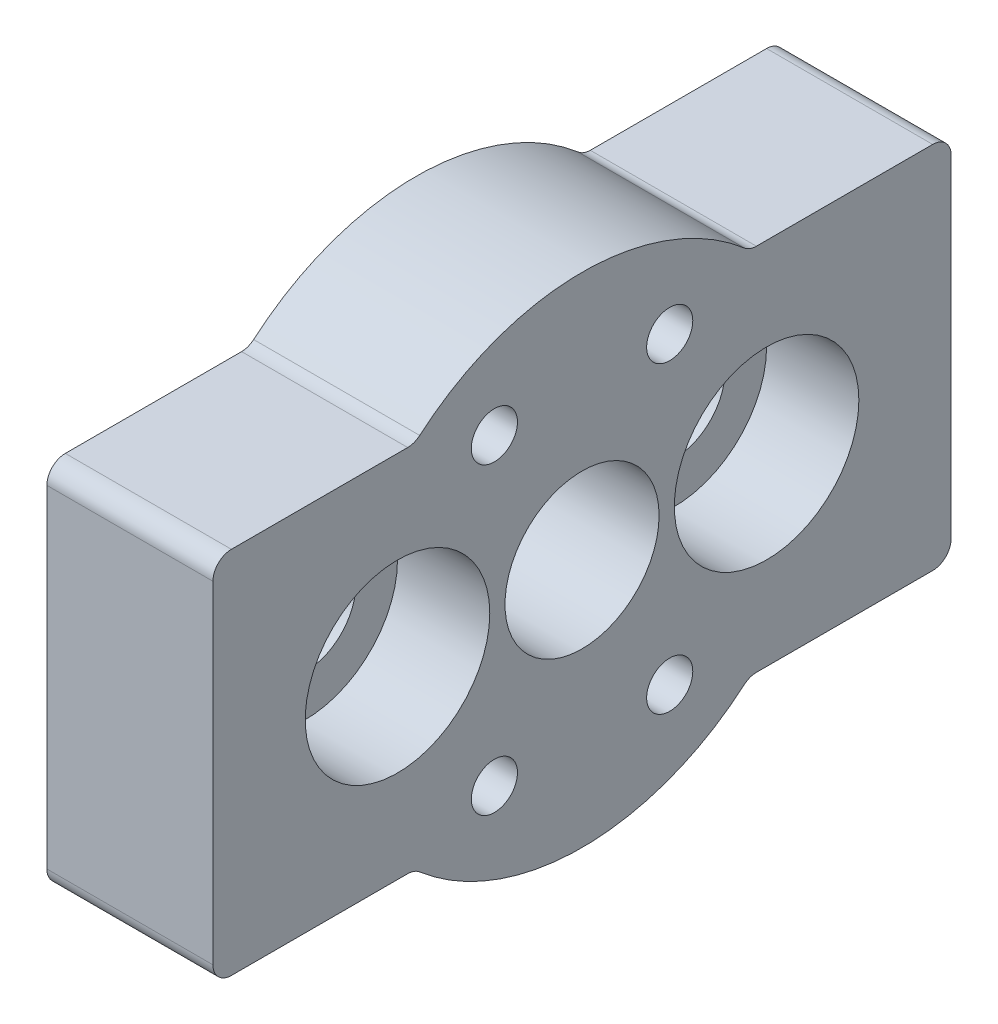
ISO-10303-21;
HEADER;
FILE_DESCRIPTION(('STEP AP214'),'2;1');
FILE_NAME('part.step','',(''),(''),'','','');
FILE_SCHEMA(('AUTOMOTIVE_DESIGN { 1 0 10303 214 1 1 1 1 }'));
ENDSEC;
DATA;
#1=APPLICATION_CONTEXT('core data for automotive mechanical design processes');
#2=APPLICATION_PROTOCOL_DEFINITION('international standard','automotive_design',2000,#1);
#3=PRODUCT_CONTEXT('',#1,'mechanical');
#4=PRODUCT('Part','Part','',(#3));
#5=PRODUCT_RELATED_PRODUCT_CATEGORY('part','',(#4));
#6=PRODUCT_DEFINITION_FORMATION('','',#4);
#7=PRODUCT_DEFINITION_CONTEXT('part definition',#1,'design');
#8=PRODUCT_DEFINITION('design','',#6,#7);
#9=PRODUCT_DEFINITION_SHAPE('','',#8);
#10=(LENGTH_UNIT() NAMED_UNIT(*) SI_UNIT(.MILLI.,.METRE.));
#11=(NAMED_UNIT(*) PLANE_ANGLE_UNIT() SI_UNIT($,.RADIAN.));
#12=(NAMED_UNIT(*) SI_UNIT($,.STERADIAN.) SOLID_ANGLE_UNIT());
#13=UNCERTAINTY_MEASURE_WITH_UNIT(LENGTH_MEASURE(1.E-05),#10,'distance_accuracy_value','');
#14=(GEOMETRIC_REPRESENTATION_CONTEXT(3) GLOBAL_UNCERTAINTY_ASSIGNED_CONTEXT((#13)) GLOBAL_UNIT_ASSIGNED_CONTEXT((#10,
#11,#12)) REPRESENTATION_CONTEXT('',''));
#15=CARTESIAN_POINT('',(0.,0.,0.));
#16=DIRECTION('',(0.,0.,1.));
#17=DIRECTION('',(1.,0.,0.));
#18=AXIS2_PLACEMENT_3D('',#15,#16,#17);
#19=CARTESIAN_POINT('',(-9.,0.,0.));
#20=DIRECTION('',(1.,0.,0.));
#21=DIRECTION('',(0.,0.,-1.));
#22=AXIS2_PLACEMENT_3D('',#19,#20,#21);
#23=CYLINDRICAL_SURFACE('',#22,13.5);
#24=CARTESIAN_POINT('',(0.,0.,0.));
#25=DIRECTION('',(1.,0.,0.));
#26=DIRECTION('',(0.,0.,-1.));
#27=AXIS2_PLACEMENT_3D('',#24,#25,#26);
#28=CIRCLE('',#27,13.5);
#29=CARTESIAN_POINT('',(0.,10.2413793103448,8.79568927495969));
#30=VERTEX_POINT('',#29);
#31=CARTESIAN_POINT('',(0.,10.2413793103448,-8.79568927495969));
#32=VERTEX_POINT('',#31);
#33=EDGE_CURVE('E180',#30,#32,#28,.F.);
#34=ORIENTED_EDGE('',*,*,#33,.T.);
#35=DIRECTION('',(1.,0.,0.));
#36=VECTOR('',#35,1.);
#37=CARTESIAN_POINT('',(-9.,10.2413793103448,-8.79568927495969));
#38=LINE('',#37,#36);
#39=CARTESIAN_POINT('',(-9.,10.2413793103448,-8.79568927495969));
#40=VERTEX_POINT('',#39);
#41=EDGE_CURVE('E234',#32,#40,#38,.F.);
#42=ORIENTED_EDGE('',*,*,#41,.T.);
#43=CARTESIAN_POINT('',(-9.,0.,0.));
#44=DIRECTION('',(1.,0.,0.));
#45=DIRECTION('',(0.,0.,-1.));
#46=AXIS2_PLACEMENT_3D('',#43,#44,#45);
#47=CIRCLE('',#46,13.5);
#48=CARTESIAN_POINT('',(-9.,10.2413793103448,8.79568927495969));
#49=VERTEX_POINT('',#48);
#50=EDGE_CURVE('E194',#49,#40,#47,.F.);
#51=ORIENTED_EDGE('',*,*,#50,.F.);
#52=DIRECTION('',(1.,0.,0.));
#53=VECTOR('',#52,1.);
#54=CARTESIAN_POINT('',(-9.,10.2413793103448,8.79568927495969));
#55=LINE('',#54,#53);
#56=EDGE_CURVE('E231',#49,#30,#55,.T.);
#57=ORIENTED_EDGE('',*,*,#56,.T.);
#58=EDGE_LOOP('',(#34,#42,#51,#57));
#59=FACE_BOUND('',#58,.T.);
#60=ADVANCED_FACE('F34',(#59),#23,.T.);
#61=CARTESIAN_POINT('',(-9.,10.,0.));
#62=DIRECTION('',(0.,-1.,0.));
#63=DIRECTION('',(0.,0.,-1.));
#64=AXIS2_PLACEMENT_3D('',#61,#62,#63);
#65=PLANE('',#64);
#66=DIRECTION('',(0.,0.,-1.));
#67=VECTOR('',#66,1.);
#68=CARTESIAN_POINT('',(0.,10.,0.));
#69=LINE('',#68,#67);
#70=CARTESIAN_POINT('',(0.,10.,-9.44722181384559));
#71=VERTEX_POINT('',#70);
#72=CARTESIAN_POINT('',(0.,10.,-19.));
#73=VERTEX_POINT('',#72);
#74=EDGE_CURVE('E182',#71,#73,#69,.T.);
#75=ORIENTED_EDGE('',*,*,#74,.T.);
#76=DIRECTION('',(1.,0.,0.));
#77=VECTOR('',#76,1.);
#78=CARTESIAN_POINT('',(-9.,10.,-19.));
#79=LINE('',#78,#77);
#80=CARTESIAN_POINT('',(-9.,10.,-19.));
#81=VERTEX_POINT('',#80);
#82=EDGE_CURVE('E229',#73,#81,#79,.F.);
#83=ORIENTED_EDGE('',*,*,#82,.T.);
#84=DIRECTION('',(0.,0.,-1.));
#85=VECTOR('',#84,1.);
#86=CARTESIAN_POINT('',(-9.,10.,0.));
#87=LINE('',#86,#85);
#88=CARTESIAN_POINT('',(-9.,10.,-9.44722181384559));
#89=VERTEX_POINT('',#88);
#90=EDGE_CURVE('E270',#89,#81,#87,.T.);
#91=ORIENTED_EDGE('',*,*,#90,.F.);
#92=DIRECTION('',(-1.,0.,0.));
#93=VECTOR('',#92,1.);
#94=CARTESIAN_POINT('',(0.,10.,-9.44722181384559));
#95=LINE('',#94,#93);
#96=EDGE_CURVE('E226',#89,#71,#95,.F.);
#97=ORIENTED_EDGE('',*,*,#96,.T.);
#98=EDGE_LOOP('',(#75,#83,#91,#97));
#99=FACE_BOUND('',#98,.T.);
#100=ADVANCED_FACE('F371',(#99),#65,.F.);
#101=CARTESIAN_POINT('',(-9.,0.,-20.));
#102=DIRECTION('',(0.,0.,-1.));
#103=DIRECTION('',(-1.,0.,0.));
#104=AXIS2_PLACEMENT_3D('',#101,#102,#103);
#105=PLANE('',#104);
#106=DIRECTION('',(0.,1.,0.));
#107=VECTOR('',#106,1.);
#108=CARTESIAN_POINT('',(0.,0.,-20.));
#109=LINE('',#108,#107);
#110=CARTESIAN_POINT('',(0.,-9.,-20.));
#111=VERTEX_POINT('',#110);
#112=CARTESIAN_POINT('',(0.,9.,-20.));
#113=VERTEX_POINT('',#112);
#114=EDGE_CURVE('E186',#111,#113,#109,.T.);
#115=ORIENTED_EDGE('',*,*,#114,.F.);
#116=DIRECTION('',(1.,0.,0.));
#117=VECTOR('',#116,1.);
#118=CARTESIAN_POINT('',(-9.,-9.,-20.));
#119=LINE('',#118,#117);
#120=CARTESIAN_POINT('',(-9.,-9.,-20.));
#121=VERTEX_POINT('',#120);
#122=EDGE_CURVE('E224',#111,#121,#119,.F.);
#123=ORIENTED_EDGE('',*,*,#122,.T.);
#124=DIRECTION('',(0.,1.,0.));
#125=VECTOR('',#124,1.);
#126=CARTESIAN_POINT('',(-9.,0.,-20.));
#127=LINE('',#126,#125);
#128=CARTESIAN_POINT('',(-9.,9.,-20.));
#129=VERTEX_POINT('',#128);
#130=EDGE_CURVE('E280',#121,#129,#127,.T.);
#131=ORIENTED_EDGE('',*,*,#130,.T.);
#132=DIRECTION('',(1.,0.,0.));
#133=VECTOR('',#132,1.);
#134=CARTESIAN_POINT('',(0.,9.,-20.));
#135=LINE('',#134,#133);
#136=EDGE_CURVE('E221',#129,#113,#135,.T.);
#137=ORIENTED_EDGE('',*,*,#136,.T.);
#138=EDGE_LOOP('',(#115,#123,#131,#137));
#139=FACE_BOUND('',#138,.T.);
#140=ADVANCED_FACE('F376',(#139),#105,.T.);
#141=CARTESIAN_POINT('',(-9.,-10.,0.));
#142=DIRECTION('',(0.,-1.,0.));
#143=DIRECTION('',(0.,0.,-1.));
#144=AXIS2_PLACEMENT_3D('',#141,#142,#143);
#145=PLANE('',#144);
#146=DIRECTION('',(0.,0.,-1.));
#147=VECTOR('',#146,1.);
#148=CARTESIAN_POINT('',(0.,-10.,0.));
#149=LINE('',#148,#147);
#150=CARTESIAN_POINT('',(0.,-10.,-9.44722181384559));
#151=VERTEX_POINT('',#150);
#152=CARTESIAN_POINT('',(0.,-10.,-19.));
#153=VERTEX_POINT('',#152);
#154=EDGE_CURVE('E179',#151,#153,#149,.T.);
#155=ORIENTED_EDGE('',*,*,#154,.F.);
#156=DIRECTION('',(-1.,0.,0.));
#157=VECTOR('',#156,1.);
#158=CARTESIAN_POINT('',(-9.,-10.,-9.44722181384559));
#159=LINE('',#158,#157);
#160=CARTESIAN_POINT('',(-9.,-10.,-9.44722181384559));
#161=VERTEX_POINT('',#160);
#162=EDGE_CURVE('E219',#151,#161,#159,.T.);
#163=ORIENTED_EDGE('',*,*,#162,.T.);
#164=DIRECTION('',(0.,0.,-1.));
#165=VECTOR('',#164,1.);
#166=CARTESIAN_POINT('',(-9.,-10.,0.));
#167=LINE('',#166,#165);
#168=CARTESIAN_POINT('',(-9.,-10.,-19.));
#169=VERTEX_POINT('',#168);
#170=EDGE_CURVE('E277',#161,#169,#167,.T.);
#171=ORIENTED_EDGE('',*,*,#170,.T.);
#172=DIRECTION('',(1.,0.,0.));
#173=VECTOR('',#172,1.);
#174=CARTESIAN_POINT('',(-9.,-10.,-19.));
#175=LINE('',#174,#173);
#176=EDGE_CURVE('E216',#169,#153,#175,.T.);
#177=ORIENTED_EDGE('',*,*,#176,.T.);
#178=EDGE_LOOP('',(#155,#163,#171,#177));
#179=FACE_BOUND('',#178,.T.);
#180=ADVANCED_FACE('F431',(#179),#145,.T.);
#181=CARTESIAN_POINT('',(-9.,0.,0.));
#182=DIRECTION('',(1.,0.,0.));
#183=DIRECTION('',(0.,0.,-1.));
#184=AXIS2_PLACEMENT_3D('',#181,#182,#183);
#185=CYLINDRICAL_SURFACE('',#184,13.5);
#186=CARTESIAN_POINT('',(0.,0.,0.));
#187=DIRECTION('',(1.,0.,0.));
#188=DIRECTION('',(0.,0.,-1.));
#189=AXIS2_PLACEMENT_3D('',#186,#187,#188);
#190=CIRCLE('',#189,13.5);
#191=CARTESIAN_POINT('',(0.,-10.2413793103448,8.79568927495969));
#192=VERTEX_POINT('',#191);
#193=CARTESIAN_POINT('',(0.,-10.2413793103448,-8.79568927495969));
#194=VERTEX_POINT('',#193);
#195=EDGE_CURVE('E177',#192,#194,#190,.T.);
#196=ORIENTED_EDGE('',*,*,#195,.F.);
#197=DIRECTION('',(1.,0.,0.));
#198=VECTOR('',#197,1.);
#199=CARTESIAN_POINT('',(-9.,-10.2413793103448,8.79568927495969));
#200=LINE('',#199,#198);
#201=CARTESIAN_POINT('',(-9.,-10.2413793103448,8.79568927495969));
#202=VERTEX_POINT('',#201);
#203=EDGE_CURVE('E214',#192,#202,#200,.F.);
#204=ORIENTED_EDGE('',*,*,#203,.T.);
#205=CARTESIAN_POINT('',(-9.,0.,0.));
#206=DIRECTION('',(1.,0.,0.));
#207=DIRECTION('',(0.,0.,-1.));
#208=AXIS2_PLACEMENT_3D('',#205,#206,#207);
#209=CIRCLE('',#208,13.5);
#210=CARTESIAN_POINT('',(-9.,-10.2413793103448,-8.79568927495969));
#211=VERTEX_POINT('',#210);
#212=EDGE_CURVE('E281',#202,#211,#209,.T.);
#213=ORIENTED_EDGE('',*,*,#212,.T.);
#214=DIRECTION('',(1.,0.,0.));
#215=VECTOR('',#214,1.);
#216=CARTESIAN_POINT('',(-9.,-10.2413793103448,-8.79568927495969));
#217=LINE('',#216,#215);
#218=EDGE_CURVE('E211',#211,#194,#217,.T.);
#219=ORIENTED_EDGE('',*,*,#218,.T.);
#220=EDGE_LOOP('',(#196,#204,#213,#219));
#221=FACE_BOUND('',#220,.T.);
#222=ADVANCED_FACE('F425',(#221),#185,.T.);
#223=CARTESIAN_POINT('',(0.,-10.,19.));
#224=VERTEX_POINT('',#223);
#225=CARTESIAN_POINT('',(0.,-10.,9.44722181384559));
#226=VERTEX_POINT('',#225);
#227=EDGE_CURVE('E174',#224,#226,#149,.T.);
#228=ORIENTED_EDGE('',*,*,#227,.F.);
#229=DIRECTION('',(1.,0.,0.));
#230=VECTOR('',#229,1.);
#231=CARTESIAN_POINT('',(-9.,-10.,19.));
#232=LINE('',#231,#230);
#233=CARTESIAN_POINT('',(-9.,-10.,19.));
#234=VERTEX_POINT('',#233);
#235=EDGE_CURVE('E153',#224,#234,#232,.F.);
#236=ORIENTED_EDGE('',*,*,#235,.T.);
#237=CARTESIAN_POINT('',(-9.,-10.,9.44722181384559));
#238=VERTEX_POINT('',#237);
#239=EDGE_CURVE('E276',#234,#238,#167,.T.);
#240=ORIENTED_EDGE('',*,*,#239,.T.);
#241=DIRECTION('',(-1.,0.,0.));
#242=VECTOR('',#241,1.);
#243=CARTESIAN_POINT('',(0.,-10.,9.44722181384559));
#244=LINE('',#243,#242);
#245=EDGE_CURVE('E158',#238,#226,#244,.F.);
#246=ORIENTED_EDGE('',*,*,#245,.T.);
#247=EDGE_LOOP('',(#228,#236,#240,#246));
#248=FACE_BOUND('',#247,.T.);
#249=ADVANCED_FACE('F421',(#248),#145,.T.);
#250=CARTESIAN_POINT('',(-9.,0.,20.));
#251=DIRECTION('',(0.,0.,-1.));
#252=DIRECTION('',(-1.,0.,0.));
#253=AXIS2_PLACEMENT_3D('',#250,#251,#252);
#254=PLANE('',#253);
#255=DIRECTION('',(0.,1.,0.));
#256=VECTOR('',#255,1.);
#257=CARTESIAN_POINT('',(-9.,0.,20.));
#258=LINE('',#257,#256);
#259=CARTESIAN_POINT('',(-9.,-9.,20.));
#260=VERTEX_POINT('',#259);
#261=CARTESIAN_POINT('',(-9.,9.,20.));
#262=VERTEX_POINT('',#261);
#263=EDGE_CURVE('E167',#260,#262,#258,.T.);
#264=ORIENTED_EDGE('',*,*,#263,.F.);
#265=DIRECTION('',(1.,0.,0.));
#266=VECTOR('',#265,1.);
#267=CARTESIAN_POINT('',(0.,-9.,20.));
#268=LINE('',#267,#266);
#269=CARTESIAN_POINT('',(0.,-9.,20.));
#270=VERTEX_POINT('',#269);
#271=EDGE_CURVE('E152',#260,#270,#268,.T.);
#272=ORIENTED_EDGE('',*,*,#271,.T.);
#273=DIRECTION('',(0.,1.,0.));
#274=VECTOR('',#273,1.);
#275=CARTESIAN_POINT('',(0.,0.,20.));
#276=LINE('',#275,#274);
#277=CARTESIAN_POINT('',(0.,9.,20.));
#278=VERTEX_POINT('',#277);
#279=EDGE_CURVE('E165',#270,#278,#276,.T.);
#280=ORIENTED_EDGE('',*,*,#279,.T.);
#281=DIRECTION('',(1.,0.,0.));
#282=VECTOR('',#281,1.);
#283=CARTESIAN_POINT('',(-9.,9.,20.));
#284=LINE('',#283,#282);
#285=EDGE_CURVE('E169',#278,#262,#284,.F.);
#286=ORIENTED_EDGE('',*,*,#285,.T.);
#287=EDGE_LOOP('',(#264,#272,#280,#286));
#288=FACE_BOUND('',#287,.T.);
#289=ADVANCED_FACE('F164',(#288),#254,.F.);
#290=CARTESIAN_POINT('',(0.,10.,19.));
#291=VERTEX_POINT('',#290);
#292=CARTESIAN_POINT('',(0.,10.,9.44722181384559));
#293=VERTEX_POINT('',#292);
#294=EDGE_CURVE('E175',#291,#293,#69,.T.);
#295=ORIENTED_EDGE('',*,*,#294,.T.);
#296=DIRECTION('',(-1.,0.,0.));
#297=VECTOR('',#296,1.);
#298=CARTESIAN_POINT('',(-9.,10.,9.44722181384559));
#299=LINE('',#298,#297);
#300=CARTESIAN_POINT('',(-9.,10.,9.44722181384559));
#301=VERTEX_POINT('',#300);
#302=EDGE_CURVE('E49',#293,#301,#299,.T.);
#303=ORIENTED_EDGE('',*,*,#302,.T.);
#304=CARTESIAN_POINT('',(-9.,10.,19.));
#305=VERTEX_POINT('',#304);
#306=EDGE_CURVE('E265',#305,#301,#87,.T.);
#307=ORIENTED_EDGE('',*,*,#306,.F.);
#308=DIRECTION('',(1.,0.,0.));
#309=VECTOR('',#308,1.);
#310=CARTESIAN_POINT('',(-9.,10.,19.));
#311=LINE('',#310,#309);
#312=EDGE_CURVE('E236',#305,#291,#311,.T.);
#313=ORIENTED_EDGE('',*,*,#312,.T.);
#314=EDGE_LOOP('',(#295,#303,#307,#313));
#315=FACE_BOUND('',#314,.T.);
#316=ADVANCED_FACE('F255',(#315),#65,.F.);
#317=CARTESIAN_POINT('',(-9.,0.,0.));
#318=DIRECTION('',(1.,0.,0.));
#319=DIRECTION('',(0.,0.,-1.));
#320=AXIS2_PLACEMENT_3D('',#317,#318,#319);
#321=CYLINDRICAL_SURFACE('',#320,4.175);
#322=CARTESIAN_POINT('',(-9.,0.,0.));
#323=DIRECTION('',(1.,0.,0.));
#324=DIRECTION('',(0.,0.,-1.));
#325=AXIS2_PLACEMENT_3D('',#322,#323,#324);
#326=CIRCLE('',#325,4.175);
#327=CARTESIAN_POINT('',(-9.,0.,-4.17500000000001));
#328=VERTEX_POINT('',#327);
#329=EDGE_CURVE('E195',#328,#328,#326,.T.);
#330=ORIENTED_EDGE('',*,*,#329,.F.);
#331=EDGE_LOOP('',(#330));
#332=FACE_BOUND('',#331,.T.);
#333=CARTESIAN_POINT('',(0.,0.,0.));
#334=DIRECTION('',(1.,0.,0.));
#335=DIRECTION('',(0.,0.,-1.));
#336=AXIS2_PLACEMENT_3D('',#333,#334,#335);
#337=CIRCLE('',#336,4.175);
#338=CARTESIAN_POINT('',(0.,0.,-4.17500000000001));
#339=VERTEX_POINT('',#338);
#340=EDGE_CURVE('E191',#339,#339,#337,.T.);
#341=ORIENTED_EDGE('',*,*,#340,.T.);
#342=EDGE_LOOP('',(#341));
#343=FACE_BOUND('',#342,.T.);
#344=ADVANCED_FACE('F464',(#332,#343),#321,.F.);
#345=CARTESIAN_POINT('',(-9.,0.,0.));
#346=DIRECTION('',(1.,0.,0.));
#347=DIRECTION('',(0.,0.,-1.));
#348=AXIS2_PLACEMENT_3D('',#345,#346,#347);
#349=PLANE('',#348);
#350=CARTESIAN_POINT('',(-9.,8.22724133595219,4.74999999999995));
#351=DIRECTION('',(1.,0.,0.));
#352=DIRECTION('',(0.,0.,-1.));
#353=AXIS2_PLACEMENT_3D('',#350,#351,#352);
#354=CIRCLE('',#353,1.25);
#355=CARTESIAN_POINT('',(-9.,8.22724133595219,3.49999999999996));
#356=VERTEX_POINT('',#355);
#357=EDGE_CURVE('E331',#356,#356,#354,.T.);
#358=ORIENTED_EDGE('',*,*,#357,.T.);
#359=EDGE_LOOP('',(#358));
#360=FACE_BOUND('',#359,.T.);
#361=CARTESIAN_POINT('',(-9.,-8.2272413359522,4.74999999999995));
#362=DIRECTION('',(1.,0.,0.));
#363=DIRECTION('',(0.,0.,-1.));
#364=AXIS2_PLACEMENT_3D('',#361,#362,#363);
#365=CIRCLE('',#364,1.25);
#366=CARTESIAN_POINT('',(-9.,-8.2272413359522,3.49999999999995));
#367=VERTEX_POINT('',#366);
#368=EDGE_CURVE('E325',#367,#367,#365,.T.);
#369=ORIENTED_EDGE('',*,*,#368,.T.);
#370=EDGE_LOOP('',(#369));
#371=FACE_BOUND('',#370,.T.);
#372=CARTESIAN_POINT('',(-9.,-8.22724133595216,-4.75000000000001));
#373=DIRECTION('',(1.,0.,0.));
#374=DIRECTION('',(0.,0.,-1.));
#375=AXIS2_PLACEMENT_3D('',#372,#373,#374);
#376=CIRCLE('',#375,1.25);
#377=CARTESIAN_POINT('',(-9.,-8.22724133595216,-6.00000000000001));
#378=VERTEX_POINT('',#377);
#379=EDGE_CURVE('E319',#378,#378,#376,.T.);
#380=ORIENTED_EDGE('',*,*,#379,.T.);
#381=EDGE_LOOP('',(#380));
#382=FACE_BOUND('',#381,.T.);
#383=CARTESIAN_POINT('',(-9.,8.2272413359522,-4.74999999999995));
#384=DIRECTION('',(1.,0.,0.));
#385=DIRECTION('',(0.,0.,-1.));
#386=AXIS2_PLACEMENT_3D('',#383,#384,#385);
#387=CIRCLE('',#386,1.25);
#388=CARTESIAN_POINT('',(-9.,8.2272413359522,-5.99999999999995));
#389=VERTEX_POINT('',#388);
#390=EDGE_CURVE('E313',#389,#389,#387,.T.);
#391=ORIENTED_EDGE('',*,*,#390,.T.);
#392=EDGE_LOOP('',(#391));
#393=FACE_BOUND('',#392,.T.);
#394=CARTESIAN_POINT('',(-9.,0.,9.99999999999999));
#395=DIRECTION('',(1.,0.,0.));
#396=DIRECTION('',(0.,0.,-1.));
#397=AXIS2_PLACEMENT_3D('',#394,#395,#396);
#398=CIRCLE('',#397,2.75);
#399=CARTESIAN_POINT('',(-9.,0.,7.25));
#400=VERTEX_POINT('',#399);
#401=EDGE_CURVE('E301',#400,#400,#398,.T.);
#402=ORIENTED_EDGE('',*,*,#401,.T.);
#403=EDGE_LOOP('',(#402));
#404=FACE_BOUND('',#403,.T.);
#405=CARTESIAN_POINT('',(-9.,0.,-10.));
#406=DIRECTION('',(1.,0.,0.));
#407=DIRECTION('',(0.,0.,-1.));
#408=AXIS2_PLACEMENT_3D('',#405,#406,#407);
#409=CIRCLE('',#408,2.75);
#410=CARTESIAN_POINT('',(-9.,0.,-12.75));
#411=VERTEX_POINT('',#410);
#412=EDGE_CURVE('E272',#411,#411,#409,.T.);
#413=ORIENTED_EDGE('',*,*,#412,.T.);
#414=EDGE_LOOP('',(#413));
#415=FACE_BOUND('',#414,.T.);
#416=ORIENTED_EDGE('',*,*,#239,.F.);
#417=CARTESIAN_POINT('',(-9.,-9.,19.));
#418=DIRECTION('',(1.,0.,0.));
#419=DIRECTION('',(0.,0.,-1.));
#420=AXIS2_PLACEMENT_3D('',#417,#418,#419);
#421=CIRCLE('',#420,1.);
#422=EDGE_CURVE('E209',#234,#260,#421,.F.);
#423=ORIENTED_EDGE('',*,*,#422,.T.);
#424=ORIENTED_EDGE('',*,*,#263,.T.);
#425=CARTESIAN_POINT('',(-9.,9.,19.));
#426=DIRECTION('',(1.,0.,0.));
#427=DIRECTION('',(0.,0.,-1.));
#428=AXIS2_PLACEMENT_3D('',#425,#426,#427);
#429=CIRCLE('',#428,1.);
#430=EDGE_CURVE('E56',#262,#305,#429,.F.);
#431=ORIENTED_EDGE('',*,*,#430,.T.);
#432=ORIENTED_EDGE('',*,*,#306,.T.);
#433=CARTESIAN_POINT('',(-9.,11.,9.44722181384559));
#434=DIRECTION('',(1.,0.,0.));
#435=DIRECTION('',(0.,0.,-1.));
#436=AXIS2_PLACEMENT_3D('',#433,#434,#435);
#437=CIRCLE('',#436,1.);
#438=EDGE_CURVE('E11',#301,#49,#437,.T.);
#439=ORIENTED_EDGE('',*,*,#438,.T.);
#440=ORIENTED_EDGE('',*,*,#50,.T.);
#441=CARTESIAN_POINT('',(-9.,11.,-9.44722181384559));
#442=DIRECTION('',(1.,0.,0.));
#443=DIRECTION('',(0.,0.,-1.));
#444=AXIS2_PLACEMENT_3D('',#441,#442,#443);
#445=CIRCLE('',#444,1.);
#446=EDGE_CURVE('E250',#40,#89,#445,.T.);
#447=ORIENTED_EDGE('',*,*,#446,.T.);
#448=ORIENTED_EDGE('',*,*,#90,.T.);
#449=CARTESIAN_POINT('',(-9.,9.,-19.));
#450=DIRECTION('',(1.,0.,0.));
#451=DIRECTION('',(0.,0.,-1.));
#452=AXIS2_PLACEMENT_3D('',#449,#450,#451);
#453=CIRCLE('',#452,1.);
#454=EDGE_CURVE('E205',#81,#129,#453,.F.);
#455=ORIENTED_EDGE('',*,*,#454,.T.);
#456=ORIENTED_EDGE('',*,*,#130,.F.);
#457=CARTESIAN_POINT('',(-9.,-9.,-19.));
#458=DIRECTION('',(1.,0.,0.));
#459=DIRECTION('',(0.,0.,-1.));
#460=AXIS2_PLACEMENT_3D('',#457,#458,#459);
#461=CIRCLE('',#460,1.);
#462=EDGE_CURVE('E207',#121,#169,#461,.F.);
#463=ORIENTED_EDGE('',*,*,#462,.T.);
#464=ORIENTED_EDGE('',*,*,#170,.F.);
#465=CARTESIAN_POINT('',(-9.,-11.,-9.44722181384559));
#466=DIRECTION('',(1.,0.,0.));
#467=DIRECTION('',(0.,0.,-1.));
#468=AXIS2_PLACEMENT_3D('',#465,#466,#467);
#469=CIRCLE('',#468,1.);
#470=EDGE_CURVE('E246',#161,#211,#469,.T.);
#471=ORIENTED_EDGE('',*,*,#470,.T.);
#472=ORIENTED_EDGE('',*,*,#212,.F.);
#473=CARTESIAN_POINT('',(-9.,-11.,9.44722181384559));
#474=DIRECTION('',(1.,0.,0.));
#475=DIRECTION('',(0.,0.,-1.));
#476=AXIS2_PLACEMENT_3D('',#473,#474,#475);
#477=CIRCLE('',#476,1.);
#478=EDGE_CURVE('E242',#202,#238,#477,.T.);
#479=ORIENTED_EDGE('',*,*,#478,.T.);
#480=EDGE_LOOP('',(#416,#423,#424,#431,#432,#439,#440,#447,#448,#455,#456,#463,#464,#471,#472,#479));
#481=FACE_BOUND('',#480,.T.);
#482=ORIENTED_EDGE('',*,*,#329,.T.);
#483=EDGE_LOOP('',(#482));
#484=FACE_BOUND('',#483,.T.);
#485=ADVANCED_FACE('F262',(#360,#371,#382,#393,#404,#415,#481,#484),#349,.F.);
#486=CARTESIAN_POINT('',(0.,0.,0.));
#487=DIRECTION('',(1.,0.,0.));
#488=DIRECTION('',(0.,0.,-1.));
#489=AXIS2_PLACEMENT_3D('',#486,#487,#488);
#490=PLANE('',#489);
#491=CARTESIAN_POINT('',(0.,8.22724133595219,4.74999999999995));
#492=DIRECTION('',(1.,0.,0.));
#493=DIRECTION('',(0.,0.,-1.));
#494=AXIS2_PLACEMENT_3D('',#491,#492,#493);
#495=CIRCLE('',#494,1.25);
#496=CARTESIAN_POINT('',(0.,8.22724133595219,3.49999999999995));
#497=VERTEX_POINT('',#496);
#498=EDGE_CURVE('E334',#497,#497,#495,.T.);
#499=ORIENTED_EDGE('',*,*,#498,.F.);
#500=EDGE_LOOP('',(#499));
#501=FACE_BOUND('',#500,.T.);
#502=CARTESIAN_POINT('',(0.,-8.2272413359522,4.74999999999995));
#503=DIRECTION('',(1.,0.,0.));
#504=DIRECTION('',(0.,0.,-1.));
#505=AXIS2_PLACEMENT_3D('',#502,#503,#504);
#506=CIRCLE('',#505,1.25);
#507=CARTESIAN_POINT('',(0.,-8.2272413359522,3.49999999999995));
#508=VERTEX_POINT('',#507);
#509=EDGE_CURVE('E328',#508,#508,#506,.T.);
#510=ORIENTED_EDGE('',*,*,#509,.F.);
#511=EDGE_LOOP('',(#510));
#512=FACE_BOUND('',#511,.T.);
#513=CARTESIAN_POINT('',(0.,-8.22724133595216,-4.75000000000001));
#514=DIRECTION('',(1.,0.,0.));
#515=DIRECTION('',(0.,0.,-1.));
#516=AXIS2_PLACEMENT_3D('',#513,#514,#515);
#517=CIRCLE('',#516,1.25);
#518=CARTESIAN_POINT('',(0.,-8.22724133595216,-6.00000000000001));
#519=VERTEX_POINT('',#518);
#520=EDGE_CURVE('E322',#519,#519,#517,.T.);
#521=ORIENTED_EDGE('',*,*,#520,.F.);
#522=EDGE_LOOP('',(#521));
#523=FACE_BOUND('',#522,.T.);
#524=CARTESIAN_POINT('',(0.,8.2272413359522,-4.74999999999995));
#525=DIRECTION('',(1.,0.,0.));
#526=DIRECTION('',(0.,0.,-1.));
#527=AXIS2_PLACEMENT_3D('',#524,#525,#526);
#528=CIRCLE('',#527,1.25);
#529=CARTESIAN_POINT('',(0.,8.2272413359522,-5.99999999999995));
#530=VERTEX_POINT('',#529);
#531=EDGE_CURVE('E316',#530,#530,#528,.T.);
#532=ORIENTED_EDGE('',*,*,#531,.F.);
#533=EDGE_LOOP('',(#532));
#534=FACE_BOUND('',#533,.T.);
#535=CARTESIAN_POINT('',(0.,0.,9.99999999999999));
#536=DIRECTION('',(1.,0.,0.));
#537=DIRECTION('',(0.,0.,-1.));
#538=AXIS2_PLACEMENT_3D('',#535,#536,#537);
#539=CIRCLE('',#538,4.99999999999999);
#540=CARTESIAN_POINT('',(0.,0.,5.));
#541=VERTEX_POINT('',#540);
#542=EDGE_CURVE('E310',#541,#541,#539,.T.);
#543=ORIENTED_EDGE('',*,*,#542,.F.);
#544=EDGE_LOOP('',(#543));
#545=FACE_BOUND('',#544,.T.);
#546=CARTESIAN_POINT('',(0.,0.,-10.));
#547=DIRECTION('',(1.,0.,0.));
#548=DIRECTION('',(0.,0.,-1.));
#549=AXIS2_PLACEMENT_3D('',#546,#547,#548);
#550=CIRCLE('',#549,4.99999999999999);
#551=CARTESIAN_POINT('',(0.,0.,-15.));
#552=VERTEX_POINT('',#551);
#553=EDGE_CURVE('E296',#552,#552,#550,.T.);
#554=ORIENTED_EDGE('',*,*,#553,.F.);
#555=EDGE_LOOP('',(#554));
#556=FACE_BOUND('',#555,.T.);
#557=ORIENTED_EDGE('',*,*,#279,.F.);
#558=CARTESIAN_POINT('',(0.,-9.,19.));
#559=DIRECTION('',(1.,0.,0.));
#560=DIRECTION('',(0.,0.,-1.));
#561=AXIS2_PLACEMENT_3D('',#558,#559,#560);
#562=CIRCLE('',#561,1.);
#563=EDGE_CURVE('E148',#270,#224,#562,.T.);
#564=ORIENTED_EDGE('',*,*,#563,.T.);
#565=ORIENTED_EDGE('',*,*,#227,.T.);
#566=CARTESIAN_POINT('',(0.,-11.,9.44722181384559));
#567=DIRECTION('',(1.,0.,0.));
#568=DIRECTION('',(0.,0.,-1.));
#569=AXIS2_PLACEMENT_3D('',#566,#567,#568);
#570=CIRCLE('',#569,1.);
#571=EDGE_CURVE('E240',#226,#192,#570,.F.);
#572=ORIENTED_EDGE('',*,*,#571,.T.);
#573=ORIENTED_EDGE('',*,*,#195,.T.);
#574=CARTESIAN_POINT('',(0.,-11.,-9.44722181384559));
#575=DIRECTION('',(1.,0.,0.));
#576=DIRECTION('',(0.,0.,-1.));
#577=AXIS2_PLACEMENT_3D('',#574,#575,#576);
#578=CIRCLE('',#577,1.);
#579=EDGE_CURVE('E244',#194,#151,#578,.F.);
#580=ORIENTED_EDGE('',*,*,#579,.T.);
#581=ORIENTED_EDGE('',*,*,#154,.T.);
#582=CARTESIAN_POINT('',(0.,-9.,-19.));
#583=DIRECTION('',(1.,0.,0.));
#584=DIRECTION('',(0.,0.,-1.));
#585=AXIS2_PLACEMENT_3D('',#582,#583,#584);
#586=CIRCLE('',#585,1.);
#587=EDGE_CURVE('E159',#153,#111,#586,.T.);
#588=ORIENTED_EDGE('',*,*,#587,.T.);
#589=ORIENTED_EDGE('',*,*,#114,.T.);
#590=CARTESIAN_POINT('',(0.,9.,-19.));
#591=DIRECTION('',(1.,0.,0.));
#592=DIRECTION('',(0.,0.,-1.));
#593=AXIS2_PLACEMENT_3D('',#590,#591,#592);
#594=CIRCLE('',#593,1.);
#595=EDGE_CURVE('E198',#113,#73,#594,.T.);
#596=ORIENTED_EDGE('',*,*,#595,.T.);
#597=ORIENTED_EDGE('',*,*,#74,.F.);
#598=CARTESIAN_POINT('',(0.,11.,-9.44722181384559));
#599=DIRECTION('',(1.,0.,0.));
#600=DIRECTION('',(0.,0.,-1.));
#601=AXIS2_PLACEMENT_3D('',#598,#599,#600);
#602=CIRCLE('',#601,1.);
#603=EDGE_CURVE('E248',#71,#32,#602,.F.);
#604=ORIENTED_EDGE('',*,*,#603,.T.);
#605=ORIENTED_EDGE('',*,*,#33,.F.);
#606=CARTESIAN_POINT('',(0.,11.,9.44722181384559));
#607=DIRECTION('',(1.,0.,0.));
#608=DIRECTION('',(0.,0.,-1.));
#609=AXIS2_PLACEMENT_3D('',#606,#607,#608);
#610=CIRCLE('',#609,1.);
#611=EDGE_CURVE('E42',#30,#293,#610,.F.);
#612=ORIENTED_EDGE('',*,*,#611,.T.);
#613=ORIENTED_EDGE('',*,*,#294,.F.);
#614=CARTESIAN_POINT('',(0.,9.,19.));
#615=DIRECTION('',(1.,0.,0.));
#616=DIRECTION('',(0.,0.,-1.));
#617=AXIS2_PLACEMENT_3D('',#614,#615,#616);
#618=CIRCLE('',#617,1.);
#619=EDGE_CURVE('E168',#291,#278,#618,.T.);
#620=ORIENTED_EDGE('',*,*,#619,.T.);
#621=EDGE_LOOP('',(#557,#564,#565,#572,#573,#580,#581,#588,#589,#596,#597,#604,#605,#612,#613,#620));
#622=FACE_BOUND('',#621,.T.);
#623=ORIENTED_EDGE('',*,*,#340,.F.);
#624=EDGE_LOOP('',(#623));
#625=FACE_BOUND('',#624,.T.);
#626=ADVANCED_FACE('F171',(#501,#512,#523,#534,#545,#556,#622,#625),#490,.T.);
#627=CARTESIAN_POINT('',(0.,0.,-10.));
#628=DIRECTION('',(1.,0.,0.));
#629=DIRECTION('',(0.,0.,-1.));
#630=AXIS2_PLACEMENT_3D('',#627,#628,#629);
#631=CYLINDRICAL_SURFACE('',#630,2.75);
#632=ORIENTED_EDGE('',*,*,#412,.F.);
#633=EDGE_LOOP('',(#632));
#634=FACE_BOUND('',#633,.T.);
#635=CARTESIAN_POINT('',(-5.,0.,-10.));
#636=DIRECTION('',(1.,0.,0.));
#637=DIRECTION('',(0.,0.,-1.));
#638=AXIS2_PLACEMENT_3D('',#635,#636,#637);
#639=CIRCLE('',#638,2.75000000000001);
#640=CARTESIAN_POINT('',(-5.,0.,-12.75));
#641=VERTEX_POINT('',#640);
#642=EDGE_CURVE('E288',#641,#641,#639,.T.);
#643=ORIENTED_EDGE('',*,*,#642,.T.);
#644=EDGE_LOOP('',(#643));
#645=FACE_BOUND('',#644,.T.);
#646=ADVANCED_FACE('F342',(#634,#645),#631,.F.);
#647=CARTESIAN_POINT('',(-5.,2.75000000000001,-10.));
#648=DIRECTION('',(-1.,0.,0.));
#649=DIRECTION('',(0.,0.,1.));
#650=AXIS2_PLACEMENT_3D('',#647,#648,#649);
#651=PLANE('',#650);
#652=ORIENTED_EDGE('',*,*,#642,.F.);
#653=EDGE_LOOP('',(#652));
#654=FACE_BOUND('',#653,.T.);
#655=CARTESIAN_POINT('',(-5.,0.,-10.));
#656=DIRECTION('',(1.,0.,0.));
#657=DIRECTION('',(0.,0.,-1.));
#658=AXIS2_PLACEMENT_3D('',#655,#656,#657);
#659=CIRCLE('',#658,4.99999999999999);
#660=CARTESIAN_POINT('',(-5.,0.,-15.));
#661=VERTEX_POINT('',#660);
#662=EDGE_CURVE('E292',#661,#661,#659,.T.);
#663=ORIENTED_EDGE('',*,*,#662,.T.);
#664=EDGE_LOOP('',(#663));
#665=FACE_BOUND('',#664,.T.);
#666=ADVANCED_FACE('F357',(#654,#665),#651,.F.);
#667=CARTESIAN_POINT('',(0.,0.,-10.));
#668=DIRECTION('',(1.,0.,0.));
#669=DIRECTION('',(0.,0.,-1.));
#670=AXIS2_PLACEMENT_3D('',#667,#668,#669);
#671=CYLINDRICAL_SURFACE('',#670,4.99999999999999);
#672=ORIENTED_EDGE('',*,*,#662,.F.);
#673=EDGE_LOOP('',(#672));
#674=FACE_BOUND('',#673,.T.);
#675=ORIENTED_EDGE('',*,*,#553,.T.);
#676=EDGE_LOOP('',(#675));
#677=FACE_BOUND('',#676,.T.);
#678=ADVANCED_FACE('F354',(#674,#677),#671,.F.);
#679=CARTESIAN_POINT('',(0.,0.,9.99999999999999));
#680=DIRECTION('',(1.,0.,0.));
#681=DIRECTION('',(0.,0.,-1.));
#682=AXIS2_PLACEMENT_3D('',#679,#680,#681);
#683=CYLINDRICAL_SURFACE('',#682,2.75);
#684=ORIENTED_EDGE('',*,*,#401,.F.);
#685=EDGE_LOOP('',(#684));
#686=FACE_BOUND('',#685,.T.);
#687=CARTESIAN_POINT('',(-5.,0.,9.99999999999999));
#688=DIRECTION('',(1.,0.,0.));
#689=DIRECTION('',(0.,0.,-1.));
#690=AXIS2_PLACEMENT_3D('',#687,#688,#689);
#691=CIRCLE('',#690,2.75000000000001);
#692=CARTESIAN_POINT('',(-5.,0.,7.24999999999999));
#693=VERTEX_POINT('',#692);
#694=EDGE_CURVE('E304',#693,#693,#691,.T.);
#695=ORIENTED_EDGE('',*,*,#694,.T.);
#696=EDGE_LOOP('',(#695));
#697=FACE_BOUND('',#696,.T.);
#698=ADVANCED_FACE('F356',(#686,#697),#683,.F.);
#699=CARTESIAN_POINT('',(-5.,2.75000000000001,9.99999999999999));
#700=DIRECTION('',(-1.,0.,0.));
#701=DIRECTION('',(0.,0.,1.));
#702=AXIS2_PLACEMENT_3D('',#699,#700,#701);
#703=PLANE('',#702);
#704=ORIENTED_EDGE('',*,*,#694,.F.);
#705=EDGE_LOOP('',(#704));
#706=FACE_BOUND('',#705,.T.);
#707=CARTESIAN_POINT('',(-5.,0.,9.99999999999999));
#708=DIRECTION('',(1.,0.,0.));
#709=DIRECTION('',(0.,0.,-1.));
#710=AXIS2_PLACEMENT_3D('',#707,#708,#709);
#711=CIRCLE('',#710,4.99999999999999);
#712=CARTESIAN_POINT('',(-5.,0.,5.));
#713=VERTEX_POINT('',#712);
#714=EDGE_CURVE('E307',#713,#713,#711,.T.);
#715=ORIENTED_EDGE('',*,*,#714,.T.);
#716=EDGE_LOOP('',(#715));
#717=FACE_BOUND('',#716,.T.);
#718=ADVANCED_FACE('F364',(#706,#717),#703,.F.);
#719=CARTESIAN_POINT('',(0.,0.,9.99999999999999));
#720=DIRECTION('',(1.,0.,0.));
#721=DIRECTION('',(0.,0.,-1.));
#722=AXIS2_PLACEMENT_3D('',#719,#720,#721);
#723=CYLINDRICAL_SURFACE('',#722,4.99999999999999);
#724=ORIENTED_EDGE('',*,*,#714,.F.);
#725=EDGE_LOOP('',(#724));
#726=FACE_BOUND('',#725,.T.);
#727=ORIENTED_EDGE('',*,*,#542,.T.);
#728=EDGE_LOOP('',(#727));
#729=FACE_BOUND('',#728,.T.);
#730=ADVANCED_FACE('F385',(#726,#729),#723,.F.);
#731=CARTESIAN_POINT('',(-9.,-9.,19.));
#732=DIRECTION('',(-1.,0.,0.));
#733=DIRECTION('',(0.,0.,1.));
#734=AXIS2_PLACEMENT_3D('',#731,#732,#733);
#735=CYLINDRICAL_SURFACE('',#734,1.);
#736=ORIENTED_EDGE('',*,*,#422,.F.);
#737=ORIENTED_EDGE('',*,*,#235,.F.);
#738=ORIENTED_EDGE('',*,*,#563,.F.);
#739=ORIENTED_EDGE('',*,*,#271,.F.);
#740=EDGE_LOOP('',(#736,#737,#738,#739));
#741=FACE_BOUND('',#740,.T.);
#742=ADVANCED_FACE('F151',(#741),#735,.T.);
#743=CARTESIAN_POINT('',(-9.,-11.,9.44722181384559));
#744=DIRECTION('',(1.,0.,0.));
#745=DIRECTION('',(0.,0.,-1.));
#746=AXIS2_PLACEMENT_3D('',#743,#744,#745);
#747=CYLINDRICAL_SURFACE('',#746,1.);
#748=ORIENTED_EDGE('',*,*,#478,.F.);
#749=ORIENTED_EDGE('',*,*,#203,.F.);
#750=ORIENTED_EDGE('',*,*,#571,.F.);
#751=ORIENTED_EDGE('',*,*,#245,.F.);
#752=EDGE_LOOP('',(#748,#749,#750,#751));
#753=FACE_BOUND('',#752,.T.);
#754=ADVANCED_FACE('F384',(#753),#747,.F.);
#755=CARTESIAN_POINT('',(-9.,-11.,-9.44722181384559));
#756=DIRECTION('',(1.,0.,0.));
#757=DIRECTION('',(0.,0.,-1.));
#758=AXIS2_PLACEMENT_3D('',#755,#756,#757);
#759=CYLINDRICAL_SURFACE('',#758,1.);
#760=ORIENTED_EDGE('',*,*,#470,.F.);
#761=ORIENTED_EDGE('',*,*,#162,.F.);
#762=ORIENTED_EDGE('',*,*,#579,.F.);
#763=ORIENTED_EDGE('',*,*,#218,.F.);
#764=EDGE_LOOP('',(#760,#761,#762,#763));
#765=FACE_BOUND('',#764,.T.);
#766=ADVANCED_FACE('F388',(#765),#759,.F.);
#767=CARTESIAN_POINT('',(-9.,-9.,-19.));
#768=DIRECTION('',(1.,0.,0.));
#769=DIRECTION('',(0.,0.,-1.));
#770=AXIS2_PLACEMENT_3D('',#767,#768,#769);
#771=CYLINDRICAL_SURFACE('',#770,1.);
#772=ORIENTED_EDGE('',*,*,#462,.F.);
#773=ORIENTED_EDGE('',*,*,#122,.F.);
#774=ORIENTED_EDGE('',*,*,#587,.F.);
#775=ORIENTED_EDGE('',*,*,#176,.F.);
#776=EDGE_LOOP('',(#772,#773,#774,#775));
#777=FACE_BOUND('',#776,.T.);
#778=ADVANCED_FACE('F392',(#777),#771,.T.);
#779=CARTESIAN_POINT('',(-9.,9.,-19.));
#780=DIRECTION('',(-1.,0.,0.));
#781=DIRECTION('',(0.,0.,1.));
#782=AXIS2_PLACEMENT_3D('',#779,#780,#781);
#783=CYLINDRICAL_SURFACE('',#782,1.);
#784=ORIENTED_EDGE('',*,*,#454,.F.);
#785=ORIENTED_EDGE('',*,*,#82,.F.);
#786=ORIENTED_EDGE('',*,*,#595,.F.);
#787=ORIENTED_EDGE('',*,*,#136,.F.);
#788=EDGE_LOOP('',(#784,#785,#786,#787));
#789=FACE_BOUND('',#788,.T.);
#790=ADVANCED_FACE('F396',(#789),#783,.T.);
#791=CARTESIAN_POINT('',(-9.,11.,-9.44722181384559));
#792=DIRECTION('',(1.,0.,0.));
#793=DIRECTION('',(0.,0.,-1.));
#794=AXIS2_PLACEMENT_3D('',#791,#792,#793);
#795=CYLINDRICAL_SURFACE('',#794,1.);
#796=ORIENTED_EDGE('',*,*,#446,.F.);
#797=ORIENTED_EDGE('',*,*,#41,.F.);
#798=ORIENTED_EDGE('',*,*,#603,.F.);
#799=ORIENTED_EDGE('',*,*,#96,.F.);
#800=EDGE_LOOP('',(#796,#797,#798,#799));
#801=FACE_BOUND('',#800,.T.);
#802=ADVANCED_FACE('F400',(#801),#795,.F.);
#803=CARTESIAN_POINT('',(-9.,11.,9.44722181384559));
#804=DIRECTION('',(1.,0.,0.));
#805=DIRECTION('',(0.,0.,-1.));
#806=AXIS2_PLACEMENT_3D('',#803,#804,#805);
#807=CYLINDRICAL_SURFACE('',#806,1.);
#808=ORIENTED_EDGE('',*,*,#438,.F.);
#809=ORIENTED_EDGE('',*,*,#302,.F.);
#810=ORIENTED_EDGE('',*,*,#611,.F.);
#811=ORIENTED_EDGE('',*,*,#56,.F.);
#812=EDGE_LOOP('',(#808,#809,#810,#811));
#813=FACE_BOUND('',#812,.T.);
#814=ADVANCED_FACE('F258',(#813),#807,.F.);
#815=CARTESIAN_POINT('',(-9.,9.,19.));
#816=DIRECTION('',(1.,0.,0.));
#817=DIRECTION('',(0.,0.,-1.));
#818=AXIS2_PLACEMENT_3D('',#815,#816,#817);
#819=CYLINDRICAL_SURFACE('',#818,1.);
#820=ORIENTED_EDGE('',*,*,#430,.F.);
#821=ORIENTED_EDGE('',*,*,#285,.F.);
#822=ORIENTED_EDGE('',*,*,#619,.F.);
#823=ORIENTED_EDGE('',*,*,#312,.F.);
#824=EDGE_LOOP('',(#820,#821,#822,#823));
#825=FACE_BOUND('',#824,.T.);
#826=ADVANCED_FACE('F36',(#825),#819,.T.);
#827=CARTESIAN_POINT('',(0.,8.2272413359522,-4.74999999999995));
#828=DIRECTION('',(1.,0.,0.));
#829=DIRECTION('',(0.,0.,-1.));
#830=AXIS2_PLACEMENT_3D('',#827,#828,#829);
#831=CYLINDRICAL_SURFACE('',#830,1.25);
#832=ORIENTED_EDGE('',*,*,#390,.F.);
#833=EDGE_LOOP('',(#832));
#834=FACE_BOUND('',#833,.T.);
#835=ORIENTED_EDGE('',*,*,#531,.T.);
#836=EDGE_LOOP('',(#835));
#837=FACE_BOUND('',#836,.T.);
#838=ADVANCED_FACE('F408',(#834,#837),#831,.F.);
#839=CARTESIAN_POINT('',(0.,-8.22724133595216,-4.75000000000001));
#840=DIRECTION('',(1.,0.,0.));
#841=DIRECTION('',(0.,0.,-1.));
#842=AXIS2_PLACEMENT_3D('',#839,#840,#841);
#843=CYLINDRICAL_SURFACE('',#842,1.25);
#844=ORIENTED_EDGE('',*,*,#379,.F.);
#845=EDGE_LOOP('',(#844));
#846=FACE_BOUND('',#845,.T.);
#847=ORIENTED_EDGE('',*,*,#520,.T.);
#848=EDGE_LOOP('',(#847));
#849=FACE_BOUND('',#848,.T.);
#850=ADVANCED_FACE('F413',(#846,#849),#843,.F.);
#851=CARTESIAN_POINT('',(0.,-8.2272413359522,4.74999999999995));
#852=DIRECTION('',(1.,0.,0.));
#853=DIRECTION('',(0.,0.,-1.));
#854=AXIS2_PLACEMENT_3D('',#851,#852,#853);
#855=CYLINDRICAL_SURFACE('',#854,1.25);
#856=ORIENTED_EDGE('',*,*,#368,.F.);
#857=EDGE_LOOP('',(#856));
#858=FACE_BOUND('',#857,.T.);
#859=ORIENTED_EDGE('',*,*,#509,.T.);
#860=EDGE_LOOP('',(#859));
#861=FACE_BOUND('',#860,.T.);
#862=ADVANCED_FACE('F624',(#858,#861),#855,.F.);
#863=CARTESIAN_POINT('',(0.,8.22724133595219,4.74999999999995));
#864=DIRECTION('',(1.,0.,0.));
#865=DIRECTION('',(0.,0.,-1.));
#866=AXIS2_PLACEMENT_3D('',#863,#864,#865);
#867=CYLINDRICAL_SURFACE('',#866,1.25);
#868=ORIENTED_EDGE('',*,*,#357,.F.);
#869=EDGE_LOOP('',(#868));
#870=FACE_BOUND('',#869,.T.);
#871=ORIENTED_EDGE('',*,*,#498,.T.);
#872=EDGE_LOOP('',(#871));
#873=FACE_BOUND('',#872,.T.);
#874=ADVANCED_FACE('F338',(#870,#873),#867,.F.);
#875=CLOSED_SHELL('',(#60,#100,#140,#180,#222,#249,#289,#316,#344,#485,#626,#646,#666,#678,#698,
#718,#730,#742,#754,#766,#778,#790,#802,#814,#826,#838,#850,#862,#874));
#876=MANIFOLD_SOLID_BREP('B2',#875);
#877=ADVANCED_BREP_SHAPE_REPRESENTATION('',(#18,#876),#14);
#878=SHAPE_DEFINITION_REPRESENTATION(#9,#877);
ENDSEC;
END-ISO-10303-21;
